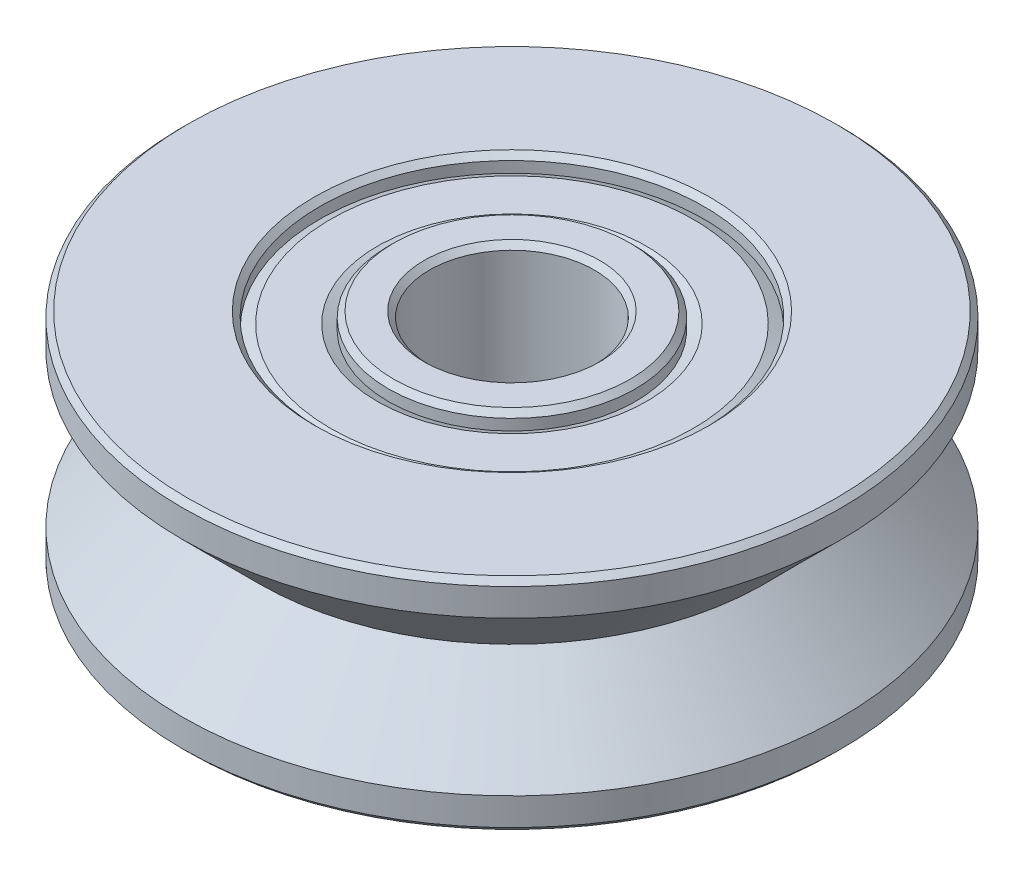
ISO-10303-21;
HEADER;
FILE_DESCRIPTION(('STEP AP214'),'2;1');
FILE_NAME('part.step','',(''),(''),'','','');
FILE_SCHEMA(('AUTOMOTIVE_DESIGN { 1 0 10303 214 1 1 1 1 }'));
ENDSEC;
DATA;
#1=APPLICATION_CONTEXT('core data for automotive mechanical design processes');
#2=APPLICATION_PROTOCOL_DEFINITION('international standard','automotive_design',2000,#1);
#3=PRODUCT_CONTEXT('',#1,'mechanical');
#4=PRODUCT('Part','Part','',(#3));
#5=PRODUCT_RELATED_PRODUCT_CATEGORY('part','',(#4));
#6=PRODUCT_DEFINITION_FORMATION('','',#4);
#7=PRODUCT_DEFINITION_CONTEXT('part definition',#1,'design');
#8=PRODUCT_DEFINITION('design','',#6,#7);
#9=PRODUCT_DEFINITION_SHAPE('','',#8);
#10=(LENGTH_UNIT() NAMED_UNIT(*) SI_UNIT(.MILLI.,.METRE.));
#11=(NAMED_UNIT(*) PLANE_ANGLE_UNIT() SI_UNIT($,.RADIAN.));
#12=(NAMED_UNIT(*) SI_UNIT($,.STERADIAN.) SOLID_ANGLE_UNIT());
#13=UNCERTAINTY_MEASURE_WITH_UNIT(LENGTH_MEASURE(1.E-05),#10,'distance_accuracy_value','');
#14=(GEOMETRIC_REPRESENTATION_CONTEXT(3) GLOBAL_UNCERTAINTY_ASSIGNED_CONTEXT((#13)) GLOBAL_UNIT_ASSIGNED_CONTEXT((#10,
#11,#12)) REPRESENTATION_CONTEXT('',''));
#15=CARTESIAN_POINT('',(0.,0.,0.));
#16=DIRECTION('',(0.,0.,1.));
#17=DIRECTION('',(1.,0.,0.));
#18=AXIS2_PLACEMENT_3D('',#15,#16,#17);
#19=CARTESIAN_POINT('',(0.,-2.,0.));
#20=DIRECTION('',(0.,1.,0.));
#21=DIRECTION('',(0.,0.,1.));
#22=AXIS2_PLACEMENT_3D('',#19,#20,#21);
#23=PLANE('',#22);
#24=CARTESIAN_POINT('',(0.,-2.,0.));
#25=DIRECTION('',(0.,1.,0.));
#26=DIRECTION('',(0.,0.,1.));
#27=AXIS2_PLACEMENT_3D('',#24,#25,#26);
#28=CIRCLE('',#27,3.6);
#29=CARTESIAN_POINT('',(0.,-2.,3.6));
#30=VERTEX_POINT('',#29);
#31=EDGE_CURVE('E62',#30,#30,#28,.T.);
#32=ORIENTED_EDGE('',*,*,#31,.T.);
#33=EDGE_LOOP('',(#32));
#34=FACE_BOUND('',#33,.T.);
#35=CARTESIAN_POINT('',(0.,-2.,0.));
#36=DIRECTION('',(0.,1.,0.));
#37=DIRECTION('',(0.,0.,1.));
#38=AXIS2_PLACEMENT_3D('',#35,#36,#37);
#39=CIRCLE('',#38,5.9);
#40=CARTESIAN_POINT('',(0.,-2.,5.9));
#41=VERTEX_POINT('',#40);
#42=EDGE_CURVE('E65',#41,#41,#39,.F.);
#43=ORIENTED_EDGE('',*,*,#42,.T.);
#44=EDGE_LOOP('',(#43));
#45=FACE_BOUND('',#44,.T.);
#46=ADVANCED_FACE('F36',(#34,#45),#23,.F.);
#47=CARTESIAN_POINT('',(0.,-2.,0.));
#48=DIRECTION('',(0.,1.,0.));
#49=DIRECTION('',(0.,0.,1.));
#50=AXIS2_PLACEMENT_3D('',#47,#48,#49);
#51=CIRCLE('',#50,1.6);
#52=CARTESIAN_POINT('',(0.,-2.,1.6));
#53=VERTEX_POINT('',#52);
#54=EDGE_CURVE('E74',#53,#53,#51,.T.);
#55=ORIENTED_EDGE('',*,*,#54,.T.);
#56=EDGE_LOOP('',(#55));
#57=FACE_BOUND('',#56,.T.);
#58=CARTESIAN_POINT('',(0.,-2.,0.));
#59=DIRECTION('',(0.,1.,0.));
#60=DIRECTION('',(0.,0.,1.));
#61=AXIS2_PLACEMENT_3D('',#58,#59,#60);
#62=CIRCLE('',#61,2.15);
#63=CARTESIAN_POINT('',(0.,-2.,2.15));
#64=VERTEX_POINT('',#63);
#65=EDGE_CURVE('E77',#64,#64,#62,.F.);
#66=ORIENTED_EDGE('',*,*,#65,.T.);
#67=EDGE_LOOP('',(#66));
#68=FACE_BOUND('',#67,.T.);
#69=ADVANCED_FACE('F152',(#57,#68),#23,.F.);
#70=CARTESIAN_POINT('',(0.,2.,0.));
#71=DIRECTION('',(0.,1.,0.));
#72=DIRECTION('',(0.,0.,1.));
#73=AXIS2_PLACEMENT_3D('',#70,#71,#72);
#74=PLANE('',#73);
#75=CARTESIAN_POINT('',(0.,2.,0.));
#76=DIRECTION('',(0.,1.,0.));
#77=DIRECTION('',(0.,0.,1.));
#78=AXIS2_PLACEMENT_3D('',#75,#76,#77);
#79=CIRCLE('',#78,3.6);
#80=CARTESIAN_POINT('',(0.,2.,3.6));
#81=VERTEX_POINT('',#80);
#82=EDGE_CURVE('E47',#81,#81,#79,.F.);
#83=ORIENTED_EDGE('',*,*,#82,.T.);
#84=EDGE_LOOP('',(#83));
#85=FACE_BOUND('',#84,.T.);
#86=CARTESIAN_POINT('',(0.,2.,0.));
#87=DIRECTION('',(0.,1.,0.));
#88=DIRECTION('',(0.,0.,1.));
#89=AXIS2_PLACEMENT_3D('',#86,#87,#88);
#90=CIRCLE('',#89,5.9);
#91=CARTESIAN_POINT('',(0.,2.,5.9));
#92=VERTEX_POINT('',#91);
#93=EDGE_CURVE('E51',#92,#92,#90,.T.);
#94=ORIENTED_EDGE('',*,*,#93,.T.);
#95=EDGE_LOOP('',(#94));
#96=FACE_BOUND('',#95,.T.);
#97=ADVANCED_FACE('F158',(#85,#96),#74,.T.);
#98=CARTESIAN_POINT('',(0.,2.,0.));
#99=DIRECTION('',(0.,1.,0.));
#100=DIRECTION('',(0.,0.,1.));
#101=AXIS2_PLACEMENT_3D('',#98,#99,#100);
#102=CIRCLE('',#101,1.6);
#103=CARTESIAN_POINT('',(0.,2.,1.6));
#104=VERTEX_POINT('',#103);
#105=EDGE_CURVE('E80',#104,#104,#102,.F.);
#106=ORIENTED_EDGE('',*,*,#105,.T.);
#107=EDGE_LOOP('',(#106));
#108=FACE_BOUND('',#107,.T.);
#109=CARTESIAN_POINT('',(0.,2.,0.));
#110=DIRECTION('',(0.,1.,0.));
#111=DIRECTION('',(0.,0.,1.));
#112=AXIS2_PLACEMENT_3D('',#109,#110,#111);
#113=CIRCLE('',#112,2.15);
#114=CARTESIAN_POINT('',(0.,2.,2.15));
#115=VERTEX_POINT('',#114);
#116=EDGE_CURVE('E83',#115,#115,#113,.T.);
#117=ORIENTED_EDGE('',*,*,#116,.T.);
#118=EDGE_LOOP('',(#117));
#119=FACE_BOUND('',#118,.T.);
#120=ADVANCED_FACE('F169',(#108,#119),#74,.T.);
#121=CARTESIAN_POINT('',(0.,2.,0.));
#122=DIRECTION('',(0.,1.,0.));
#123=DIRECTION('',(0.,0.,1.));
#124=AXIS2_PLACEMENT_3D('',#121,#122,#123);
#125=CYLINDRICAL_SURFACE('',#124,1.5);
#126=CARTESIAN_POINT('',(0.,1.9,0.));
#127=DIRECTION('',(0.,1.,0.));
#128=DIRECTION('',(0.,0.,1.));
#129=AXIS2_PLACEMENT_3D('',#126,#127,#128);
#130=CIRCLE('',#129,1.5);
#131=CARTESIAN_POINT('',(0.,1.9,1.5));
#132=VERTEX_POINT('',#131);
#133=EDGE_CURVE('E86',#132,#132,#130,.T.);
#134=ORIENTED_EDGE('',*,*,#133,.T.);
#135=EDGE_LOOP('',(#134));
#136=FACE_BOUND('',#135,.T.);
#137=CARTESIAN_POINT('',(0.,-1.9,0.));
#138=DIRECTION('',(0.,1.,0.));
#139=DIRECTION('',(0.,0.,1.));
#140=AXIS2_PLACEMENT_3D('',#137,#138,#139);
#141=CIRCLE('',#140,1.5);
#142=CARTESIAN_POINT('',(0.,-1.9,1.5));
#143=VERTEX_POINT('',#142);
#144=EDGE_CURVE('E89',#143,#143,#141,.F.);
#145=ORIENTED_EDGE('',*,*,#144,.T.);
#146=EDGE_LOOP('',(#145));
#147=FACE_BOUND('',#146,.T.);
#148=ADVANCED_FACE('F165',(#136,#147),#125,.F.);
#149=CARTESIAN_POINT('',(0.,2.,0.));
#150=DIRECTION('',(0.,1.,0.));
#151=DIRECTION('',(0.,0.,1.));
#152=AXIS2_PLACEMENT_3D('',#149,#150,#151);
#153=CYLINDRICAL_SURFACE('',#152,6.);
#154=CARTESIAN_POINT('',(0.,-1.9,0.));
#155=DIRECTION('',(0.,1.,0.));
#156=DIRECTION('',(0.,0.,1.));
#157=AXIS2_PLACEMENT_3D('',#154,#155,#156);
#158=CIRCLE('',#157,6.);
#159=CARTESIAN_POINT('',(0.,-1.9,6.));
#160=VERTEX_POINT('',#159);
#161=EDGE_CURVE('E43',#160,#160,#158,.T.);
#162=ORIENTED_EDGE('',*,*,#161,.T.);
#163=EDGE_LOOP('',(#162));
#164=FACE_BOUND('',#163,.T.);
#165=CARTESIAN_POINT('',(0.,-1.4,0.));
#166=DIRECTION('',(0.,1.,0.));
#167=DIRECTION('',(0.,0.,1.));
#168=AXIS2_PLACEMENT_3D('',#165,#166,#167);
#169=CIRCLE('',#168,6.);
#170=CARTESIAN_POINT('',(0.,-1.4,6.));
#171=VERTEX_POINT('',#170);
#172=EDGE_CURVE('E92',#171,#171,#169,.T.);
#173=ORIENTED_EDGE('',*,*,#172,.F.);
#174=EDGE_LOOP('',(#173));
#175=FACE_BOUND('',#174,.T.);
#176=ADVANCED_FACE('F168',(#164,#175),#153,.T.);
#177=CARTESIAN_POINT('',(0.,0.,0.));
#178=DIRECTION('',(0.,-1.,0.));
#179=DIRECTION('',(0.,0.,-1.));
#180=AXIS2_PLACEMENT_3D('',#177,#178,#179);
#181=CONICAL_SURFACE('',#180,4.6,0.785398163397448);
#182=ORIENTED_EDGE('',*,*,#172,.T.);
#183=EDGE_LOOP('',(#182));
#184=FACE_BOUND('',#183,.T.);
#185=CARTESIAN_POINT('',(0.,0.,0.));
#186=DIRECTION('',(0.,1.,0.));
#187=DIRECTION('',(0.,0.,1.));
#188=AXIS2_PLACEMENT_3D('',#185,#186,#187);
#189=CIRCLE('',#188,4.6);
#190=CARTESIAN_POINT('',(0.,0.,4.6));
#191=VERTEX_POINT('',#190);
#192=EDGE_CURVE('E95',#191,#191,#189,.T.);
#193=ORIENTED_EDGE('',*,*,#192,.F.);
#194=EDGE_LOOP('',(#193));
#195=FACE_BOUND('',#194,.T.);
#196=ADVANCED_FACE('F163',(#184,#195),#181,.T.);
#197=CARTESIAN_POINT('',(0.,1.4,0.));
#198=DIRECTION('',(0.,1.,0.));
#199=DIRECTION('',(0.,0.,1.));
#200=AXIS2_PLACEMENT_3D('',#197,#198,#199);
#201=CONICAL_SURFACE('',#200,6.,0.785398163397449);
#202=ORIENTED_EDGE('',*,*,#192,.T.);
#203=EDGE_LOOP('',(#202));
#204=FACE_BOUND('',#203,.T.);
#205=CARTESIAN_POINT('',(0.,1.4,0.));
#206=DIRECTION('',(0.,1.,0.));
#207=DIRECTION('',(0.,0.,1.));
#208=AXIS2_PLACEMENT_3D('',#205,#206,#207);
#209=CIRCLE('',#208,6.);
#210=CARTESIAN_POINT('',(0.,1.4,6.));
#211=VERTEX_POINT('',#210);
#212=EDGE_CURVE('E98',#211,#211,#209,.T.);
#213=ORIENTED_EDGE('',*,*,#212,.F.);
#214=EDGE_LOOP('',(#213));
#215=FACE_BOUND('',#214,.T.);
#216=ADVANCED_FACE('F300',(#204,#215),#201,.T.);
#217=CARTESIAN_POINT('',(0.,1.89999999999999,0.));
#218=DIRECTION('',(0.,1.,0.));
#219=DIRECTION('',(0.,0.,1.));
#220=AXIS2_PLACEMENT_3D('',#217,#218,#219);
#221=CIRCLE('',#220,6.);
#222=CARTESIAN_POINT('',(0.,1.89999999999999,6.));
#223=VERTEX_POINT('',#222);
#224=EDGE_CURVE('E10',#223,#223,#221,.F.);
#225=ORIENTED_EDGE('',*,*,#224,.T.);
#226=EDGE_LOOP('',(#225));
#227=FACE_BOUND('',#226,.T.);
#228=ORIENTED_EDGE('',*,*,#212,.T.);
#229=EDGE_LOOP('',(#228));
#230=FACE_BOUND('',#229,.T.);
#231=ADVANCED_FACE('F295',(#227,#230),#153,.T.);
#232=CARTESIAN_POINT('',(0.,1.8,0.));
#233=DIRECTION('',(0.,-1.,0.));
#234=DIRECTION('',(0.,0.,-1.));
#235=AXIS2_PLACEMENT_3D('',#232,#233,#234);
#236=CONICAL_SURFACE('',#235,3.3,1.10714871779409);
#237=CARTESIAN_POINT('',(0.,1.7,0.));
#238=DIRECTION('',(0.,1.,0.));
#239=DIRECTION('',(0.,0.,1.));
#240=AXIS2_PLACEMENT_3D('',#237,#238,#239);
#241=CIRCLE('',#240,3.5);
#242=CARTESIAN_POINT('',(0.,1.7,3.5));
#243=VERTEX_POINT('',#242);
#244=EDGE_CURVE('E101',#243,#243,#241,.T.);
#245=ORIENTED_EDGE('',*,*,#244,.T.);
#246=EDGE_LOOP('',(#245));
#247=FACE_BOUND('',#246,.T.);
#248=CARTESIAN_POINT('',(0.,1.8,0.));
#249=DIRECTION('',(0.,1.,0.));
#250=DIRECTION('',(0.,0.,1.));
#251=AXIS2_PLACEMENT_3D('',#248,#249,#250);
#252=CIRCLE('',#251,3.3);
#253=CARTESIAN_POINT('',(0.,1.8,3.3));
#254=VERTEX_POINT('',#253);
#255=EDGE_CURVE('E110',#254,#254,#252,.T.);
#256=ORIENTED_EDGE('',*,*,#255,.F.);
#257=EDGE_LOOP('',(#256));
#258=FACE_BOUND('',#257,.T.);
#259=ADVANCED_FACE('F287',(#247,#258),#236,.T.);
#260=CARTESIAN_POINT('',(0.,2.,0.));
#261=DIRECTION('',(0.,1.,0.));
#262=DIRECTION('',(0.,0.,1.));
#263=AXIS2_PLACEMENT_3D('',#260,#261,#262);
#264=CYLINDRICAL_SURFACE('',#263,3.5);
#265=CARTESIAN_POINT('',(0.,1.9,0.));
#266=DIRECTION('',(0.,1.,0.));
#267=DIRECTION('',(0.,0.,1.));
#268=AXIS2_PLACEMENT_3D('',#265,#266,#267);
#269=CIRCLE('',#268,3.5);
#270=CARTESIAN_POINT('',(0.,1.9,3.5));
#271=VERTEX_POINT('',#270);
#272=EDGE_CURVE('E56',#271,#271,#269,.T.);
#273=ORIENTED_EDGE('',*,*,#272,.T.);
#274=EDGE_LOOP('',(#273));
#275=FACE_BOUND('',#274,.T.);
#276=ORIENTED_EDGE('',*,*,#244,.F.);
#277=EDGE_LOOP('',(#276));
#278=FACE_BOUND('',#277,.T.);
#279=ADVANCED_FACE('F275',(#275,#278),#264,.F.);
#280=CARTESIAN_POINT('',(0.,2.,0.));
#281=DIRECTION('',(0.,1.,0.));
#282=DIRECTION('',(0.,0.,1.));
#283=AXIS2_PLACEMENT_3D('',#280,#281,#282);
#284=CYLINDRICAL_SURFACE('',#283,2.25);
#285=CARTESIAN_POINT('',(0.,1.9,0.));
#286=DIRECTION('',(0.,1.,0.));
#287=DIRECTION('',(0.,0.,1.));
#288=AXIS2_PLACEMENT_3D('',#285,#286,#287);
#289=CIRCLE('',#288,2.25);
#290=CARTESIAN_POINT('',(0.,1.9,2.25));
#291=VERTEX_POINT('',#290);
#292=EDGE_CURVE('E68',#291,#291,#289,.F.);
#293=ORIENTED_EDGE('',*,*,#292,.T.);
#294=EDGE_LOOP('',(#293));
#295=FACE_BOUND('',#294,.T.);
#296=CARTESIAN_POINT('',(0.,1.7,0.));
#297=DIRECTION('',(0.,1.,0.));
#298=DIRECTION('',(0.,0.,1.));
#299=AXIS2_PLACEMENT_3D('',#296,#297,#298);
#300=CIRCLE('',#299,2.25);
#301=CARTESIAN_POINT('',(0.,1.7,2.25));
#302=VERTEX_POINT('',#301);
#303=EDGE_CURVE('E104',#302,#302,#300,.T.);
#304=ORIENTED_EDGE('',*,*,#303,.T.);
#305=EDGE_LOOP('',(#304));
#306=FACE_BOUND('',#305,.T.);
#307=ADVANCED_FACE('F269',(#295,#306),#284,.T.);
#308=CARTESIAN_POINT('',(0.,1.7,0.));
#309=DIRECTION('',(0.,1.,0.));
#310=DIRECTION('',(0.,0.,1.));
#311=AXIS2_PLACEMENT_3D('',#308,#309,#310);
#312=CONICAL_SURFACE('',#311,2.25,1.10714871779409);
#313=CARTESIAN_POINT('',(0.,1.8,0.));
#314=DIRECTION('',(0.,1.,0.));
#315=DIRECTION('',(0.,0.,1.));
#316=AXIS2_PLACEMENT_3D('',#313,#314,#315);
#317=CIRCLE('',#316,2.45);
#318=CARTESIAN_POINT('',(0.,1.8,2.45));
#319=VERTEX_POINT('',#318);
#320=EDGE_CURVE('E107',#319,#319,#317,.T.);
#321=ORIENTED_EDGE('',*,*,#320,.T.);
#322=EDGE_LOOP('',(#321));
#323=FACE_BOUND('',#322,.T.);
#324=ORIENTED_EDGE('',*,*,#303,.F.);
#325=EDGE_LOOP('',(#324));
#326=FACE_BOUND('',#325,.T.);
#327=ADVANCED_FACE('F274',(#323,#326),#312,.F.);
#328=CARTESIAN_POINT('',(0.,1.8,0.));
#329=DIRECTION('',(0.,1.,0.));
#330=DIRECTION('',(0.,0.,1.));
#331=AXIS2_PLACEMENT_3D('',#328,#329,#330);
#332=PLANE('',#331);
#333=ORIENTED_EDGE('',*,*,#255,.T.);
#334=EDGE_LOOP('',(#333));
#335=FACE_BOUND('',#334,.T.);
#336=ORIENTED_EDGE('',*,*,#320,.F.);
#337=EDGE_LOOP('',(#336));
#338=FACE_BOUND('',#337,.T.);
#339=ADVANCED_FACE('F363',(#335,#338),#332,.T.);
#340=CARTESIAN_POINT('',(0.,-1.8,0.));
#341=DIRECTION('',(0.,1.,0.));
#342=DIRECTION('',(0.,0.,-1.));
#343=AXIS2_PLACEMENT_3D('',#340,#341,#342);
#344=CONICAL_SURFACE('',#343,3.3,1.10714871779409);
#345=CARTESIAN_POINT('',(0.,-1.7,0.));
#346=DIRECTION('',(0.,1.,0.));
#347=DIRECTION('',(0.,0.,1.));
#348=AXIS2_PLACEMENT_3D('',#345,#346,#347);
#349=CIRCLE('',#348,3.5);
#350=CARTESIAN_POINT('',(0.,-1.7,3.5));
#351=VERTEX_POINT('',#350);
#352=EDGE_CURVE('E113',#351,#351,#349,.T.);
#353=ORIENTED_EDGE('',*,*,#352,.F.);
#354=EDGE_LOOP('',(#353));
#355=FACE_BOUND('',#354,.T.);
#356=CARTESIAN_POINT('',(0.,-1.8,0.));
#357=DIRECTION('',(0.,1.,0.));
#358=DIRECTION('',(0.,0.,1.));
#359=AXIS2_PLACEMENT_3D('',#356,#357,#358);
#360=CIRCLE('',#359,3.3);
#361=CARTESIAN_POINT('',(0.,-1.8,3.3));
#362=VERTEX_POINT('',#361);
#363=EDGE_CURVE('E122',#362,#362,#360,.T.);
#364=ORIENTED_EDGE('',*,*,#363,.T.);
#365=EDGE_LOOP('',(#364));
#366=FACE_BOUND('',#365,.T.);
#367=ADVANCED_FACE('F126',(#355,#366),#344,.T.);
#368=CARTESIAN_POINT('',(0.,-2.,0.));
#369=DIRECTION('',(0.,-1.,0.));
#370=DIRECTION('',(0.,0.,1.));
#371=AXIS2_PLACEMENT_3D('',#368,#369,#370);
#372=CYLINDRICAL_SURFACE('',#371,3.5);
#373=CARTESIAN_POINT('',(0.,-1.9,0.));
#374=DIRECTION('',(0.,1.,0.));
#375=DIRECTION('',(0.,0.,1.));
#376=AXIS2_PLACEMENT_3D('',#373,#374,#375);
#377=CIRCLE('',#376,3.5);
#378=CARTESIAN_POINT('',(0.,-1.9,3.5));
#379=VERTEX_POINT('',#378);
#380=EDGE_CURVE('E59',#379,#379,#377,.F.);
#381=ORIENTED_EDGE('',*,*,#380,.T.);
#382=EDGE_LOOP('',(#381));
#383=FACE_BOUND('',#382,.T.);
#384=ORIENTED_EDGE('',*,*,#352,.T.);
#385=EDGE_LOOP('',(#384));
#386=FACE_BOUND('',#385,.T.);
#387=ADVANCED_FACE('F143',(#383,#386),#372,.F.);
#388=CARTESIAN_POINT('',(0.,-2.,0.));
#389=DIRECTION('',(0.,-1.,0.));
#390=DIRECTION('',(0.,0.,1.));
#391=AXIS2_PLACEMENT_3D('',#388,#389,#390);
#392=CYLINDRICAL_SURFACE('',#391,2.25);
#393=CARTESIAN_POINT('',(0.,-1.9,0.));
#394=DIRECTION('',(0.,1.,0.));
#395=DIRECTION('',(0.,0.,1.));
#396=AXIS2_PLACEMENT_3D('',#393,#394,#395);
#397=CIRCLE('',#396,2.25);
#398=CARTESIAN_POINT('',(0.,-1.9,2.25));
#399=VERTEX_POINT('',#398);
#400=EDGE_CURVE('E71',#399,#399,#397,.T.);
#401=ORIENTED_EDGE('',*,*,#400,.T.);
#402=EDGE_LOOP('',(#401));
#403=FACE_BOUND('',#402,.T.);
#404=CARTESIAN_POINT('',(0.,-1.7,0.));
#405=DIRECTION('',(0.,1.,0.));
#406=DIRECTION('',(0.,0.,1.));
#407=AXIS2_PLACEMENT_3D('',#404,#405,#406);
#408=CIRCLE('',#407,2.25);
#409=CARTESIAN_POINT('',(0.,-1.7,2.25));
#410=VERTEX_POINT('',#409);
#411=EDGE_CURVE('E116',#410,#410,#408,.T.);
#412=ORIENTED_EDGE('',*,*,#411,.F.);
#413=EDGE_LOOP('',(#412));
#414=FACE_BOUND('',#413,.T.);
#415=ADVANCED_FACE('F138',(#403,#414),#392,.T.);
#416=CARTESIAN_POINT('',(0.,-1.7,0.));
#417=DIRECTION('',(0.,-1.,0.));
#418=DIRECTION('',(0.,0.,1.));
#419=AXIS2_PLACEMENT_3D('',#416,#417,#418);
#420=CONICAL_SURFACE('',#419,2.25,1.10714871779409);
#421=CARTESIAN_POINT('',(0.,-1.8,0.));
#422=DIRECTION('',(0.,1.,0.));
#423=DIRECTION('',(0.,0.,1.));
#424=AXIS2_PLACEMENT_3D('',#421,#422,#423);
#425=CIRCLE('',#424,2.45);
#426=CARTESIAN_POINT('',(0.,-1.8,2.45));
#427=VERTEX_POINT('',#426);
#428=EDGE_CURVE('E119',#427,#427,#425,.T.);
#429=ORIENTED_EDGE('',*,*,#428,.F.);
#430=EDGE_LOOP('',(#429));
#431=FACE_BOUND('',#430,.T.);
#432=ORIENTED_EDGE('',*,*,#411,.T.);
#433=EDGE_LOOP('',(#432));
#434=FACE_BOUND('',#433,.T.);
#435=ADVANCED_FACE('F132',(#431,#434),#420,.F.);
#436=CARTESIAN_POINT('',(0.,-1.8,0.));
#437=DIRECTION('',(0.,-1.,0.));
#438=DIRECTION('',(0.,0.,1.));
#439=AXIS2_PLACEMENT_3D('',#436,#437,#438);
#440=PLANE('',#439);
#441=ORIENTED_EDGE('',*,*,#363,.F.);
#442=EDGE_LOOP('',(#441));
#443=FACE_BOUND('',#442,.T.);
#444=ORIENTED_EDGE('',*,*,#428,.T.);
#445=EDGE_LOOP('',(#444));
#446=FACE_BOUND('',#445,.T.);
#447=ADVANCED_FACE('F128',(#443,#446),#440,.T.);
#448=CARTESIAN_POINT('',(0.,1.9,0.));
#449=DIRECTION('',(0.,1.,0.));
#450=DIRECTION('',(0.,0.,1.));
#451=AXIS2_PLACEMENT_3D('',#448,#449,#450);
#452=CONICAL_SURFACE('',#451,1.5,0.78539816339745);
#453=ORIENTED_EDGE('',*,*,#105,.F.);
#454=EDGE_LOOP('',(#453));
#455=FACE_BOUND('',#454,.T.);
#456=ORIENTED_EDGE('',*,*,#133,.F.);
#457=EDGE_LOOP('',(#456));
#458=FACE_BOUND('',#457,.T.);
#459=ADVANCED_FACE('F131',(#455,#458),#452,.F.);
#460=CARTESIAN_POINT('',(0.,-2.,0.));
#461=DIRECTION('',(0.,-1.,0.));
#462=DIRECTION('',(0.,0.,-1.));
#463=AXIS2_PLACEMENT_3D('',#460,#461,#462);
#464=CONICAL_SURFACE('',#463,1.6,0.785398163397434);
#465=ORIENTED_EDGE('',*,*,#144,.F.);
#466=EDGE_LOOP('',(#465));
#467=FACE_BOUND('',#466,.T.);
#468=ORIENTED_EDGE('',*,*,#54,.F.);
#469=EDGE_LOOP('',(#468));
#470=FACE_BOUND('',#469,.T.);
#471=ADVANCED_FACE('F176',(#467,#470),#464,.F.);
#472=CARTESIAN_POINT('',(0.,-1.9,0.));
#473=DIRECTION('',(0.,1.,0.));
#474=DIRECTION('',(0.,0.,1.));
#475=AXIS2_PLACEMENT_3D('',#472,#473,#474);
#476=CONICAL_SURFACE('',#475,2.25,0.785398163397446);
#477=ORIENTED_EDGE('',*,*,#65,.F.);
#478=EDGE_LOOP('',(#477));
#479=FACE_BOUND('',#478,.T.);
#480=ORIENTED_EDGE('',*,*,#400,.F.);
#481=EDGE_LOOP('',(#480));
#482=FACE_BOUND('',#481,.T.);
#483=ADVANCED_FACE('F180',(#479,#482),#476,.T.);
#484=CARTESIAN_POINT('',(0.,2.,0.));
#485=DIRECTION('',(0.,-1.,0.));
#486=DIRECTION('',(0.,0.,-1.));
#487=AXIS2_PLACEMENT_3D('',#484,#485,#486);
#488=CONICAL_SURFACE('',#487,2.15,0.785398163397442);
#489=ORIENTED_EDGE('',*,*,#292,.F.);
#490=EDGE_LOOP('',(#489));
#491=FACE_BOUND('',#490,.T.);
#492=ORIENTED_EDGE('',*,*,#116,.F.);
#493=EDGE_LOOP('',(#492));
#494=FACE_BOUND('',#493,.T.);
#495=ADVANCED_FACE('F184',(#491,#494),#488,.T.);
#496=CARTESIAN_POINT('',(0.,-2.,0.));
#497=DIRECTION('',(0.,-1.,0.));
#498=DIRECTION('',(0.,0.,-1.));
#499=AXIS2_PLACEMENT_3D('',#496,#497,#498);
#500=CONICAL_SURFACE('',#499,3.6,0.785398163397438);
#501=ORIENTED_EDGE('',*,*,#380,.F.);
#502=EDGE_LOOP('',(#501));
#503=FACE_BOUND('',#502,.T.);
#504=ORIENTED_EDGE('',*,*,#31,.F.);
#505=EDGE_LOOP('',(#504));
#506=FACE_BOUND('',#505,.T.);
#507=ADVANCED_FACE('F188',(#503,#506),#500,.F.);
#508=CARTESIAN_POINT('',(0.,1.9,0.));
#509=DIRECTION('',(0.,1.,0.));
#510=DIRECTION('',(0.,0.,1.));
#511=AXIS2_PLACEMENT_3D('',#508,#509,#510);
#512=CONICAL_SURFACE('',#511,3.5,0.785398163397442);
#513=ORIENTED_EDGE('',*,*,#82,.F.);
#514=EDGE_LOOP('',(#513));
#515=FACE_BOUND('',#514,.T.);
#516=ORIENTED_EDGE('',*,*,#272,.F.);
#517=EDGE_LOOP('',(#516));
#518=FACE_BOUND('',#517,.T.);
#519=ADVANCED_FACE('F192',(#515,#518),#512,.F.);
#520=CARTESIAN_POINT('',(0.,-1.9,0.));
#521=DIRECTION('',(0.,1.,0.));
#522=DIRECTION('',(0.,0.,1.));
#523=AXIS2_PLACEMENT_3D('',#520,#521,#522);
#524=CONICAL_SURFACE('',#523,6.,0.78539816339745);
#525=ORIENTED_EDGE('',*,*,#42,.F.);
#526=EDGE_LOOP('',(#525));
#527=FACE_BOUND('',#526,.T.);
#528=ORIENTED_EDGE('',*,*,#161,.F.);
#529=EDGE_LOOP('',(#528));
#530=FACE_BOUND('',#529,.T.);
#531=ADVANCED_FACE('F195',(#527,#530),#524,.T.);
#532=CARTESIAN_POINT('',(0.,2.,0.));
#533=DIRECTION('',(0.,-1.,0.));
#534=DIRECTION('',(0.,0.,-1.));
#535=AXIS2_PLACEMENT_3D('',#532,#533,#534);
#536=CONICAL_SURFACE('',#535,5.9,0.78539816339744);
#537=ORIENTED_EDGE('',*,*,#224,.F.);
#538=EDGE_LOOP('',(#537));
#539=FACE_BOUND('',#538,.T.);
#540=ORIENTED_EDGE('',*,*,#93,.F.);
#541=EDGE_LOOP('',(#540));
#542=FACE_BOUND('',#541,.T.);
#543=ADVANCED_FACE('F38',(#539,#542),#536,.T.);
#544=CLOSED_SHELL('',(#46,#69,#97,#120,#148,#176,#196,#216,#231,#259,#279,#307,#327,#339,#367,
#387,#415,#435,#447,#459,#471,#483,#495,#507,#519,#531,#543));
#545=MANIFOLD_SOLID_BREP('B2',#544);
#546=ADVANCED_BREP_SHAPE_REPRESENTATION('',(#18,#545),#14);
#547=SHAPE_DEFINITION_REPRESENTATION(#9,#546);
ENDSEC;
END-ISO-10303-21;
